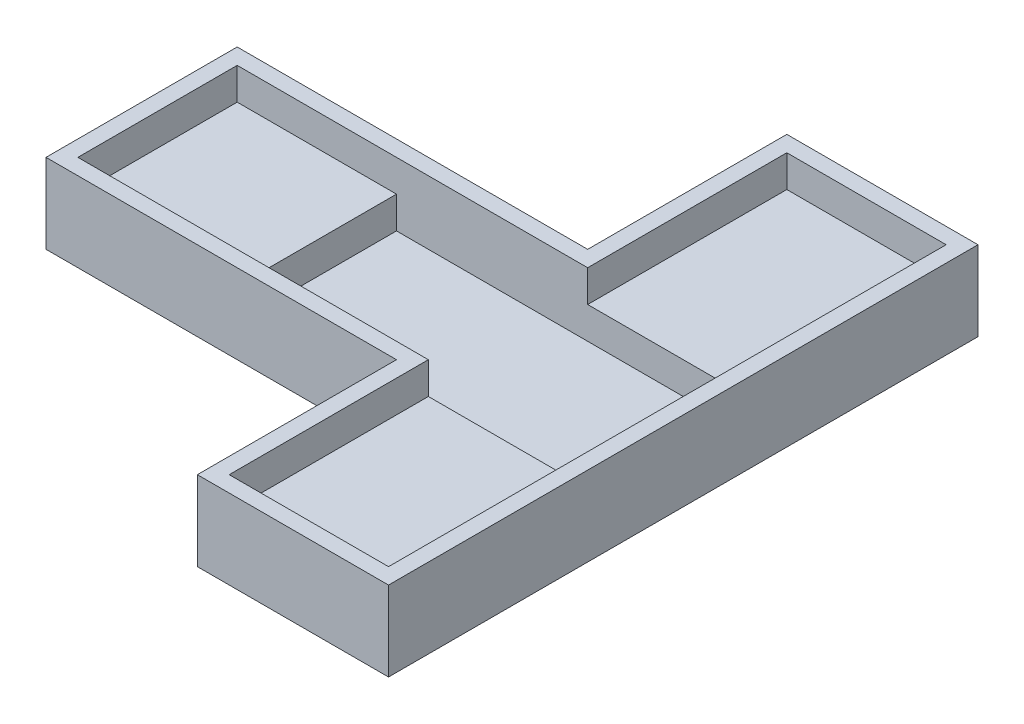
ISO-10303-21;
HEADER;
FILE_DESCRIPTION(('STEP AP214'),'2;1');
FILE_NAME('part.step','',(''),(''),'','','');
FILE_SCHEMA(('AUTOMOTIVE_DESIGN { 1 0 10303 214 1 1 1 1 }'));
ENDSEC;
DATA;
#1=APPLICATION_CONTEXT('core data for automotive mechanical design processes');
#2=APPLICATION_PROTOCOL_DEFINITION('international standard','automotive_design',2000,#1);
#3=PRODUCT_CONTEXT('',#1,'mechanical');
#4=PRODUCT('Part','Part','',(#3));
#5=PRODUCT_RELATED_PRODUCT_CATEGORY('part','',(#4));
#6=PRODUCT_DEFINITION_FORMATION('','',#4);
#7=PRODUCT_DEFINITION_CONTEXT('part definition',#1,'design');
#8=PRODUCT_DEFINITION('design','',#6,#7);
#9=PRODUCT_DEFINITION_SHAPE('','',#8);
#10=(LENGTH_UNIT() NAMED_UNIT(*) SI_UNIT(.MILLI.,.METRE.));
#11=(NAMED_UNIT(*) PLANE_ANGLE_UNIT() SI_UNIT($,.RADIAN.));
#12=(NAMED_UNIT(*) SI_UNIT($,.STERADIAN.) SOLID_ANGLE_UNIT());
#13=UNCERTAINTY_MEASURE_WITH_UNIT(LENGTH_MEASURE(1.E-05),#10,'distance_accuracy_value','');
#14=(GEOMETRIC_REPRESENTATION_CONTEXT(3) GLOBAL_UNCERTAINTY_ASSIGNED_CONTEXT((#13)) GLOBAL_UNIT_ASSIGNED_CONTEXT((#10,
#11,#12)) REPRESENTATION_CONTEXT('',''));
#15=CARTESIAN_POINT('',(0.,0.,0.));
#16=DIRECTION('',(0.,0.,1.));
#17=DIRECTION('',(1.,0.,0.));
#18=AXIS2_PLACEMENT_3D('',#15,#16,#17);
#19=CARTESIAN_POINT('',(0.,1.,0.));
#20=DIRECTION('',(0.,1.,0.));
#21=DIRECTION('',(0.,0.,1.));
#22=AXIS2_PLACEMENT_3D('',#19,#20,#21);
#23=PLANE('',#22);
#24=DIRECTION('',(1.,0.,0.));
#25=VECTOR('',#24,1.);
#26=CARTESIAN_POINT('',(0.,1.,5.));
#27=LINE('',#26,#25);
#28=CARTESIAN_POINT('',(-11.,1.,5.));
#29=VERTEX_POINT('',#28);
#30=CARTESIAN_POINT('',(11.,1.,5.));
#31=VERTEX_POINT('',#30);
#32=EDGE_CURVE('E11',#29,#31,#27,.T.);
#33=ORIENTED_EDGE('',*,*,#32,.T.);
#34=DIRECTION('',(0.,0.,1.));
#35=VECTOR('',#34,1.);
#36=CARTESIAN_POINT('',(11.,1.,0.));
#37=LINE('',#36,#35);
#38=CARTESIAN_POINT('',(11.,1.,-5.));
#39=VERTEX_POINT('',#38);
#40=EDGE_CURVE('E236',#39,#31,#37,.T.);
#41=ORIENTED_EDGE('',*,*,#40,.F.);
#42=DIRECTION('',(1.,0.,0.));
#43=VECTOR('',#42,1.);
#44=CARTESIAN_POINT('',(0.,1.,-5.));
#45=LINE('',#44,#43);
#46=CARTESIAN_POINT('',(-11.,1.,-5.));
#47=VERTEX_POINT('',#46);
#48=EDGE_CURVE('E45',#47,#39,#45,.T.);
#49=ORIENTED_EDGE('',*,*,#48,.F.);
#50=DIRECTION('',(0.,0.,-1.));
#51=VECTOR('',#50,1.);
#52=CARTESIAN_POINT('',(-11.,1.,-5.));
#53=LINE('',#52,#51);
#54=EDGE_CURVE('E269',#29,#47,#53,.T.);
#55=ORIENTED_EDGE('',*,*,#54,.F.);
#56=EDGE_LOOP('',(#33,#41,#49,#55));
#57=FACE_BOUND('',#56,.T.);
#58=ADVANCED_FACE('F37',(#57),#23,.T.);
#59=CARTESIAN_POINT('',(11.,0.,17.5));
#60=DIRECTION('',(1.,0.,0.));
#61=DIRECTION('',(0.,0.,-1.));
#62=AXIS2_PLACEMENT_3D('',#59,#60,#61);
#63=PLANE('',#62);
#64=DIRECTION('',(0.,-1.,0.));
#65=VECTOR('',#64,1.);
#66=CARTESIAN_POINT('',(11.,3.,5.));
#67=LINE('',#66,#65);
#68=CARTESIAN_POINT('',(11.,3.,5.));
#69=VERTEX_POINT('',#68);
#70=EDGE_CURVE('E276',#69,#31,#67,.T.);
#71=ORIENTED_EDGE('',*,*,#70,.F.);
#72=DIRECTION('',(0.,0.,-1.));
#73=VECTOR('',#72,1.);
#74=CARTESIAN_POINT('',(11.,3.,5.));
#75=LINE('',#74,#73);
#76=CARTESIAN_POINT('',(11.,3.,17.5));
#77=VERTEX_POINT('',#76);
#78=EDGE_CURVE('E186',#77,#69,#75,.T.);
#79=ORIENTED_EDGE('',*,*,#78,.F.);
#80=DIRECTION('',(0.,1.,0.));
#81=VECTOR('',#80,1.);
#82=CARTESIAN_POINT('',(11.,0.,17.5));
#83=LINE('',#82,#81);
#84=CARTESIAN_POINT('',(11.,5.,17.5));
#85=VERTEX_POINT('',#84);
#86=EDGE_CURVE('E185',#77,#85,#83,.T.);
#87=ORIENTED_EDGE('',*,*,#86,.T.);
#88=DIRECTION('',(0.,0.,-1.));
#89=VECTOR('',#88,1.);
#90=CARTESIAN_POINT('',(11.,5.,17.5));
#91=LINE('',#90,#89);
#92=CARTESIAN_POINT('',(11.,5.,-17.5));
#93=VERTEX_POINT('',#92);
#94=EDGE_CURVE('E305',#85,#93,#91,.T.);
#95=ORIENTED_EDGE('',*,*,#94,.T.);
#96=DIRECTION('',(0.,1.,0.));
#97=VECTOR('',#96,1.);
#98=CARTESIAN_POINT('',(11.,0.,-17.5));
#99=LINE('',#98,#97);
#100=CARTESIAN_POINT('',(11.,3.,-17.5));
#101=VERTEX_POINT('',#100);
#102=EDGE_CURVE('E210',#101,#93,#99,.T.);
#103=ORIENTED_EDGE('',*,*,#102,.F.);
#104=DIRECTION('',(0.,0.,-1.));
#105=VECTOR('',#104,1.);
#106=CARTESIAN_POINT('',(11.,3.,-5.));
#107=LINE('',#106,#105);
#108=CARTESIAN_POINT('',(11.,3.,-5.));
#109=VERTEX_POINT('',#108);
#110=EDGE_CURVE('E267',#109,#101,#107,.T.);
#111=ORIENTED_EDGE('',*,*,#110,.F.);
#112=DIRECTION('',(0.,-1.,0.));
#113=VECTOR('',#112,1.);
#114=CARTESIAN_POINT('',(11.,3.,-5.));
#115=LINE('',#114,#113);
#116=EDGE_CURVE('E257',#109,#39,#115,.T.);
#117=ORIENTED_EDGE('',*,*,#116,.T.);
#118=ORIENTED_EDGE('',*,*,#40,.T.);
#119=EDGE_LOOP('',(#71,#79,#87,#95,#103,#111,#117,#118));
#120=FACE_BOUND('',#119,.T.);
#121=ADVANCED_FACE('F265',(#120),#63,.F.);
#122=CARTESIAN_POINT('',(1.,0.,-17.5));
#123=DIRECTION('',(-1.,0.,0.));
#124=DIRECTION('',(0.,0.,1.));
#125=AXIS2_PLACEMENT_3D('',#122,#123,#124);
#126=PLANE('',#125);
#127=DIRECTION('',(0.,0.,1.));
#128=VECTOR('',#127,1.);
#129=CARTESIAN_POINT('',(0.999999999999999,3.,-5.));
#130=LINE('',#129,#128);
#131=CARTESIAN_POINT('',(1.,3.,-17.5));
#132=VERTEX_POINT('',#131);
#133=CARTESIAN_POINT('',(0.999999999999999,3.,-5.));
#134=VERTEX_POINT('',#133);
#135=EDGE_CURVE('E278',#132,#134,#130,.T.);
#136=ORIENTED_EDGE('',*,*,#135,.F.);
#137=DIRECTION('',(0.,1.,0.));
#138=VECTOR('',#137,1.);
#139=CARTESIAN_POINT('',(1.,0.,-17.5));
#140=LINE('',#139,#138);
#141=CARTESIAN_POINT('',(1.,5.,-17.5));
#142=VERTEX_POINT('',#141);
#143=EDGE_CURVE('E208',#132,#142,#140,.T.);
#144=ORIENTED_EDGE('',*,*,#143,.T.);
#145=DIRECTION('',(0.,0.,1.));
#146=VECTOR('',#145,1.);
#147=CARTESIAN_POINT('',(1.,5.,-17.5));
#148=LINE('',#147,#146);
#149=CARTESIAN_POINT('',(0.999999999999999,5.,-5.));
#150=VERTEX_POINT('',#149);
#151=EDGE_CURVE('E311',#142,#150,#148,.T.);
#152=ORIENTED_EDGE('',*,*,#151,.T.);
#153=DIRECTION('',(0.,1.,0.));
#154=VECTOR('',#153,1.);
#155=CARTESIAN_POINT('',(0.999999999999999,0.,-5.));
#156=LINE('',#155,#154);
#157=EDGE_CURVE('E60',#134,#150,#156,.T.);
#158=ORIENTED_EDGE('',*,*,#157,.F.);
#159=EDGE_LOOP('',(#136,#144,#152,#158));
#160=FACE_BOUND('',#159,.T.);
#161=ADVANCED_FACE('F392',(#160),#126,.F.);
#162=CARTESIAN_POINT('',(11.,0.,-17.5));
#163=DIRECTION('',(0.,0.,-1.));
#164=DIRECTION('',(-1.,0.,0.));
#165=AXIS2_PLACEMENT_3D('',#162,#163,#164);
#166=PLANE('',#165);
#167=DIRECTION('',(-1.,0.,0.));
#168=VECTOR('',#167,1.);
#169=CARTESIAN_POINT('',(0.999999999999999,3.,-17.5));
#170=LINE('',#169,#168);
#171=EDGE_CURVE('E270',#101,#132,#170,.T.);
#172=ORIENTED_EDGE('',*,*,#171,.F.);
#173=ORIENTED_EDGE('',*,*,#102,.T.);
#174=DIRECTION('',(-1.,0.,0.));
#175=VECTOR('',#174,1.);
#176=CARTESIAN_POINT('',(11.,5.,-17.5));
#177=LINE('',#176,#175);
#178=EDGE_CURVE('E308',#93,#142,#177,.T.);
#179=ORIENTED_EDGE('',*,*,#178,.T.);
#180=ORIENTED_EDGE('',*,*,#143,.F.);
#181=EDGE_LOOP('',(#172,#173,#179,#180));
#182=FACE_BOUND('',#181,.T.);
#183=ADVANCED_FACE('F511',(#182),#166,.F.);
#184=CARTESIAN_POINT('',(-21.,0.,5.));
#185=DIRECTION('',(0.,0.,1.));
#186=DIRECTION('',(1.,0.,0.));
#187=AXIS2_PLACEMENT_3D('',#184,#185,#186);
#188=PLANE('',#187);
#189=DIRECTION('',(0.,-1.,0.));
#190=VECTOR('',#189,1.);
#191=CARTESIAN_POINT('',(-11.,3.,5.));
#192=LINE('',#191,#190);
#193=CARTESIAN_POINT('',(-11.,3.,5.));
#194=VERTEX_POINT('',#193);
#195=EDGE_CURVE('E301',#194,#29,#192,.T.);
#196=ORIENTED_EDGE('',*,*,#195,.F.);
#197=DIRECTION('',(1.,0.,0.));
#198=VECTOR('',#197,1.);
#199=CARTESIAN_POINT('',(-21.,3.,5.));
#200=LINE('',#199,#198);
#201=CARTESIAN_POINT('',(-21.,3.,5.));
#202=VERTEX_POINT('',#201);
#203=EDGE_CURVE('E292',#202,#194,#200,.T.);
#204=ORIENTED_EDGE('',*,*,#203,.F.);
#205=DIRECTION('',(0.,1.,0.));
#206=VECTOR('',#205,1.);
#207=CARTESIAN_POINT('',(-21.,0.,5.));
#208=LINE('',#207,#206);
#209=CARTESIAN_POINT('',(-21.,5.,5.));
#210=VERTEX_POINT('',#209);
#211=EDGE_CURVE('E198',#202,#210,#208,.T.);
#212=ORIENTED_EDGE('',*,*,#211,.T.);
#213=DIRECTION('',(1.,0.,0.));
#214=VECTOR('',#213,1.);
#215=CARTESIAN_POINT('',(-21.,5.,5.));
#216=LINE('',#215,#214);
#217=CARTESIAN_POINT('',(1.,5.,5.));
#218=VERTEX_POINT('',#217);
#219=EDGE_CURVE('E319',#210,#218,#216,.T.);
#220=ORIENTED_EDGE('',*,*,#219,.T.);
#221=DIRECTION('',(0.,1.,0.));
#222=VECTOR('',#221,1.);
#223=CARTESIAN_POINT('',(1.,0.,5.));
#224=LINE('',#223,#222);
#225=CARTESIAN_POINT('',(1.,3.,5.));
#226=VERTEX_POINT('',#225);
#227=EDGE_CURVE('E193',#226,#218,#224,.T.);
#228=ORIENTED_EDGE('',*,*,#227,.F.);
#229=DIRECTION('',(-1.,0.,0.));
#230=VECTOR('',#229,1.);
#231=CARTESIAN_POINT('',(1.,3.,5.));
#232=LINE('',#231,#230);
#233=EDGE_CURVE('E52',#69,#226,#232,.T.);
#234=ORIENTED_EDGE('',*,*,#233,.F.);
#235=ORIENTED_EDGE('',*,*,#70,.T.);
#236=ORIENTED_EDGE('',*,*,#32,.F.);
#237=EDGE_LOOP('',(#196,#204,#212,#220,#228,#234,#235,#236));
#238=FACE_BOUND('',#237,.T.);
#239=ADVANCED_FACE('F277',(#238),#188,.F.);
#240=CARTESIAN_POINT('',(0.999999999999999,0.,-5.));
#241=DIRECTION('',(0.,0.,-1.));
#242=DIRECTION('',(-1.,0.,0.));
#243=AXIS2_PLACEMENT_3D('',#240,#241,#242);
#244=PLANE('',#243);
#245=DIRECTION('',(0.,-1.,0.));
#246=VECTOR('',#245,1.);
#247=CARTESIAN_POINT('',(-11.,3.,-5.));
#248=LINE('',#247,#246);
#249=CARTESIAN_POINT('',(-11.,3.,-5.));
#250=VERTEX_POINT('',#249);
#251=EDGE_CURVE('E259',#250,#47,#248,.T.);
#252=ORIENTED_EDGE('',*,*,#251,.T.);
#253=ORIENTED_EDGE('',*,*,#48,.T.);
#254=ORIENTED_EDGE('',*,*,#116,.F.);
#255=DIRECTION('',(1.,0.,0.));
#256=VECTOR('',#255,1.);
#257=CARTESIAN_POINT('',(0.999999999999999,3.,-5.));
#258=LINE('',#257,#256);
#259=EDGE_CURVE('E281',#134,#109,#258,.T.);
#260=ORIENTED_EDGE('',*,*,#259,.F.);
#261=ORIENTED_EDGE('',*,*,#157,.T.);
#262=DIRECTION('',(-1.,0.,0.));
#263=VECTOR('',#262,1.);
#264=CARTESIAN_POINT('',(0.999999999999999,5.,-5.));
#265=LINE('',#264,#263);
#266=CARTESIAN_POINT('',(-21.,5.,-5.));
#267=VERTEX_POINT('',#266);
#268=EDGE_CURVE('E313',#150,#267,#265,.T.);
#269=ORIENTED_EDGE('',*,*,#268,.T.);
#270=DIRECTION('',(0.,1.,0.));
#271=VECTOR('',#270,1.);
#272=CARTESIAN_POINT('',(-21.,0.,-5.));
#273=LINE('',#272,#271);
#274=CARTESIAN_POINT('',(-21.,3.,-5.));
#275=VERTEX_POINT('',#274);
#276=EDGE_CURVE('E205',#275,#267,#273,.T.);
#277=ORIENTED_EDGE('',*,*,#276,.F.);
#278=DIRECTION('',(-1.,0.,0.));
#279=VECTOR('',#278,1.);
#280=CARTESIAN_POINT('',(-21.,3.,-5.));
#281=LINE('',#280,#279);
#282=EDGE_CURVE('E297',#250,#275,#281,.T.);
#283=ORIENTED_EDGE('',*,*,#282,.F.);
#284=EDGE_LOOP('',(#252,#253,#254,#260,#261,#269,#277,#283));
#285=FACE_BOUND('',#284,.T.);
#286=ADVANCED_FACE('F256',(#285),#244,.F.);
#287=CARTESIAN_POINT('',(0.,0.,18.5));
#288=DIRECTION('',(0.,0.,1.));
#289=DIRECTION('',(1.,0.,0.));
#290=AXIS2_PLACEMENT_3D('',#287,#288,#289);
#291=PLANE('',#290);
#292=DIRECTION('',(0.,1.,0.));
#293=VECTOR('',#292,1.);
#294=CARTESIAN_POINT('',(12.,0.,18.5));
#295=LINE('',#294,#293);
#296=CARTESIAN_POINT('',(12.,0.,18.5));
#297=VERTEX_POINT('',#296);
#298=CARTESIAN_POINT('',(12.,5.,18.5));
#299=VERTEX_POINT('',#298);
#300=EDGE_CURVE('E233',#297,#299,#295,.T.);
#301=ORIENTED_EDGE('',*,*,#300,.T.);
#302=DIRECTION('',(1.,0.,0.));
#303=VECTOR('',#302,1.);
#304=CARTESIAN_POINT('',(0.,5.,18.5));
#305=LINE('',#304,#303);
#306=CARTESIAN_POINT('',(0.,5.,18.5));
#307=VERTEX_POINT('',#306);
#308=EDGE_CURVE('E323',#307,#299,#305,.T.);
#309=ORIENTED_EDGE('',*,*,#308,.F.);
#310=DIRECTION('',(0.,1.,0.));
#311=VECTOR('',#310,1.);
#312=CARTESIAN_POINT('',(0.,0.,18.5));
#313=LINE('',#312,#311);
#314=CARTESIAN_POINT('',(0.,0.,18.5));
#315=VERTEX_POINT('',#314);
#316=EDGE_CURVE('E234',#315,#307,#313,.T.);
#317=ORIENTED_EDGE('',*,*,#316,.F.);
#318=DIRECTION('',(1.,0.,0.));
#319=VECTOR('',#318,1.);
#320=CARTESIAN_POINT('',(0.,0.,18.5));
#321=LINE('',#320,#319);
#322=EDGE_CURVE('E192',#315,#297,#321,.T.);
#323=ORIENTED_EDGE('',*,*,#322,.T.);
#324=EDGE_LOOP('',(#301,#309,#317,#323));
#325=FACE_BOUND('',#324,.T.);
#326=ADVANCED_FACE('F351',(#325),#291,.T.);
#327=CARTESIAN_POINT('',(0.,0.,6.));
#328=DIRECTION('',(-1.,0.,0.));
#329=DIRECTION('',(0.,0.,1.));
#330=AXIS2_PLACEMENT_3D('',#327,#328,#329);
#331=PLANE('',#330);
#332=ORIENTED_EDGE('',*,*,#316,.T.);
#333=DIRECTION('',(0.,0.,1.));
#334=VECTOR('',#333,1.);
#335=CARTESIAN_POINT('',(0.,5.,6.));
#336=LINE('',#335,#334);
#337=CARTESIAN_POINT('',(0.,5.,6.));
#338=VERTEX_POINT('',#337);
#339=EDGE_CURVE('E201',#338,#307,#336,.T.);
#340=ORIENTED_EDGE('',*,*,#339,.F.);
#341=DIRECTION('',(0.,1.,0.));
#342=VECTOR('',#341,1.);
#343=CARTESIAN_POINT('',(0.,0.,6.));
#344=LINE('',#343,#342);
#345=CARTESIAN_POINT('',(0.,0.,6.));
#346=VERTEX_POINT('',#345);
#347=EDGE_CURVE('E237',#346,#338,#344,.T.);
#348=ORIENTED_EDGE('',*,*,#347,.F.);
#349=DIRECTION('',(0.,0.,1.));
#350=VECTOR('',#349,1.);
#351=CARTESIAN_POINT('',(0.,0.,6.));
#352=LINE('',#351,#350);
#353=EDGE_CURVE('E230',#346,#315,#352,.T.);
#354=ORIENTED_EDGE('',*,*,#353,.T.);
#355=EDGE_LOOP('',(#332,#340,#348,#354));
#356=FACE_BOUND('',#355,.T.);
#357=ADVANCED_FACE('F378',(#356),#331,.T.);
#358=CARTESIAN_POINT('',(-22.,0.,6.));
#359=DIRECTION('',(0.,0.,1.));
#360=DIRECTION('',(1.,0.,0.));
#361=AXIS2_PLACEMENT_3D('',#358,#359,#360);
#362=PLANE('',#361);
#363=ORIENTED_EDGE('',*,*,#347,.T.);
#364=DIRECTION('',(1.,0.,0.));
#365=VECTOR('',#364,1.);
#366=CARTESIAN_POINT('',(-22.,5.,6.));
#367=LINE('',#366,#365);
#368=CARTESIAN_POINT('',(-22.,5.,6.));
#369=VERTEX_POINT('',#368);
#370=EDGE_CURVE('E340',#369,#338,#367,.T.);
#371=ORIENTED_EDGE('',*,*,#370,.F.);
#372=DIRECTION('',(0.,1.,0.));
#373=VECTOR('',#372,1.);
#374=CARTESIAN_POINT('',(-22.,0.,6.));
#375=LINE('',#374,#373);
#376=CARTESIAN_POINT('',(-22.,0.,6.));
#377=VERTEX_POINT('',#376);
#378=EDGE_CURVE('E239',#377,#369,#375,.T.);
#379=ORIENTED_EDGE('',*,*,#378,.F.);
#380=DIRECTION('',(1.,0.,0.));
#381=VECTOR('',#380,1.);
#382=CARTESIAN_POINT('',(-22.,0.,6.));
#383=LINE('',#382,#381);
#384=EDGE_CURVE('E227',#377,#346,#383,.T.);
#385=ORIENTED_EDGE('',*,*,#384,.T.);
#386=EDGE_LOOP('',(#363,#371,#379,#385));
#387=FACE_BOUND('',#386,.T.);
#388=ADVANCED_FACE('F376',(#387),#362,.T.);
#389=CARTESIAN_POINT('',(-22.,0.,-5.99999999999999));
#390=DIRECTION('',(-1.,0.,0.));
#391=DIRECTION('',(0.,0.,1.));
#392=AXIS2_PLACEMENT_3D('',#389,#390,#391);
#393=PLANE('',#392);
#394=ORIENTED_EDGE('',*,*,#378,.T.);
#395=DIRECTION('',(0.,0.,1.));
#396=VECTOR('',#395,1.);
#397=CARTESIAN_POINT('',(-22.,5.,-5.99999999999999));
#398=LINE('',#397,#396);
#399=CARTESIAN_POINT('',(-22.,5.,-5.99999999999999));
#400=VERTEX_POINT('',#399);
#401=EDGE_CURVE('E338',#400,#369,#398,.T.);
#402=ORIENTED_EDGE('',*,*,#401,.F.);
#403=DIRECTION('',(0.,1.,0.));
#404=VECTOR('',#403,1.);
#405=CARTESIAN_POINT('',(-22.,0.,-5.99999999999999));
#406=LINE('',#405,#404);
#407=CARTESIAN_POINT('',(-22.,0.,-5.99999999999999));
#408=VERTEX_POINT('',#407);
#409=EDGE_CURVE('E241',#408,#400,#406,.T.);
#410=ORIENTED_EDGE('',*,*,#409,.F.);
#411=DIRECTION('',(0.,0.,1.));
#412=VECTOR('',#411,1.);
#413=CARTESIAN_POINT('',(-22.,0.,-5.99999999999999));
#414=LINE('',#413,#412);
#415=EDGE_CURVE('E224',#408,#377,#414,.T.);
#416=ORIENTED_EDGE('',*,*,#415,.T.);
#417=EDGE_LOOP('',(#394,#402,#410,#416));
#418=FACE_BOUND('',#417,.T.);
#419=ADVANCED_FACE('F374',(#418),#393,.T.);
#420=CARTESIAN_POINT('',(0.,0.,-6.));
#421=DIRECTION('',(0.,0.,-1.));
#422=DIRECTION('',(-1.,0.,0.));
#423=AXIS2_PLACEMENT_3D('',#420,#421,#422);
#424=PLANE('',#423);
#425=ORIENTED_EDGE('',*,*,#409,.T.);
#426=DIRECTION('',(-1.,0.,0.));
#427=VECTOR('',#426,1.);
#428=CARTESIAN_POINT('',(0.,5.,-6.));
#429=LINE('',#428,#427);
#430=CARTESIAN_POINT('',(0.,5.,-6.));
#431=VERTEX_POINT('',#430);
#432=EDGE_CURVE('E335',#431,#400,#429,.T.);
#433=ORIENTED_EDGE('',*,*,#432,.F.);
#434=DIRECTION('',(0.,1.,0.));
#435=VECTOR('',#434,1.);
#436=CARTESIAN_POINT('',(0.,0.,-6.));
#437=LINE('',#436,#435);
#438=CARTESIAN_POINT('',(0.,0.,-6.));
#439=VERTEX_POINT('',#438);
#440=EDGE_CURVE('E243',#439,#431,#437,.T.);
#441=ORIENTED_EDGE('',*,*,#440,.F.);
#442=DIRECTION('',(-1.,0.,0.));
#443=VECTOR('',#442,1.);
#444=CARTESIAN_POINT('',(0.,0.,-6.));
#445=LINE('',#444,#443);
#446=EDGE_CURVE('E221',#439,#408,#445,.T.);
#447=ORIENTED_EDGE('',*,*,#446,.T.);
#448=EDGE_LOOP('',(#425,#433,#441,#447));
#449=FACE_BOUND('',#448,.T.);
#450=ADVANCED_FACE('F370',(#449),#424,.T.);
#451=CARTESIAN_POINT('',(0.,0.,-18.5));
#452=DIRECTION('',(-1.,0.,0.));
#453=DIRECTION('',(0.,0.,1.));
#454=AXIS2_PLACEMENT_3D('',#451,#452,#453);
#455=PLANE('',#454);
#456=ORIENTED_EDGE('',*,*,#440,.T.);
#457=DIRECTION('',(0.,0.,1.));
#458=VECTOR('',#457,1.);
#459=CARTESIAN_POINT('',(0.,5.,-18.5));
#460=LINE('',#459,#458);
#461=CARTESIAN_POINT('',(0.,5.,-18.5));
#462=VERTEX_POINT('',#461);
#463=EDGE_CURVE('E332',#462,#431,#460,.T.);
#464=ORIENTED_EDGE('',*,*,#463,.F.);
#465=DIRECTION('',(0.,1.,0.));
#466=VECTOR('',#465,1.);
#467=CARTESIAN_POINT('',(0.,0.,-18.5));
#468=LINE('',#467,#466);
#469=CARTESIAN_POINT('',(0.,0.,-18.5));
#470=VERTEX_POINT('',#469);
#471=EDGE_CURVE('E245',#470,#462,#468,.T.);
#472=ORIENTED_EDGE('',*,*,#471,.F.);
#473=DIRECTION('',(0.,0.,1.));
#474=VECTOR('',#473,1.);
#475=CARTESIAN_POINT('',(0.,0.,-18.5));
#476=LINE('',#475,#474);
#477=EDGE_CURVE('E218',#470,#439,#476,.T.);
#478=ORIENTED_EDGE('',*,*,#477,.T.);
#479=EDGE_LOOP('',(#456,#464,#472,#478));
#480=FACE_BOUND('',#479,.T.);
#481=ADVANCED_FACE('F364',(#480),#455,.T.);
#482=CARTESIAN_POINT('',(12.,0.,-18.5));
#483=DIRECTION('',(0.,0.,-1.));
#484=DIRECTION('',(-1.,0.,0.));
#485=AXIS2_PLACEMENT_3D('',#482,#483,#484);
#486=PLANE('',#485);
#487=ORIENTED_EDGE('',*,*,#471,.T.);
#488=DIRECTION('',(-1.,0.,0.));
#489=VECTOR('',#488,1.);
#490=CARTESIAN_POINT('',(12.,5.,-18.5));
#491=LINE('',#490,#489);
#492=CARTESIAN_POINT('',(12.,5.,-18.5));
#493=VERTEX_POINT('',#492);
#494=EDGE_CURVE('E329',#493,#462,#491,.T.);
#495=ORIENTED_EDGE('',*,*,#494,.F.);
#496=DIRECTION('',(0.,1.,0.));
#497=VECTOR('',#496,1.);
#498=CARTESIAN_POINT('',(12.,0.,-18.5));
#499=LINE('',#498,#497);
#500=CARTESIAN_POINT('',(12.,0.,-18.5));
#501=VERTEX_POINT('',#500);
#502=EDGE_CURVE('E247',#501,#493,#499,.T.);
#503=ORIENTED_EDGE('',*,*,#502,.F.);
#504=DIRECTION('',(-1.,0.,0.));
#505=VECTOR('',#504,1.);
#506=CARTESIAN_POINT('',(12.,0.,-18.5));
#507=LINE('',#506,#505);
#508=EDGE_CURVE('E215',#501,#470,#507,.T.);
#509=ORIENTED_EDGE('',*,*,#508,.T.);
#510=EDGE_LOOP('',(#487,#495,#503,#509));
#511=FACE_BOUND('',#510,.T.);
#512=ADVANCED_FACE('F360',(#511),#486,.T.);
#513=CARTESIAN_POINT('',(12.,0.,18.5));
#514=DIRECTION('',(1.,0.,0.));
#515=DIRECTION('',(0.,0.,-1.));
#516=AXIS2_PLACEMENT_3D('',#513,#514,#515);
#517=PLANE('',#516);
#518=ORIENTED_EDGE('',*,*,#502,.T.);
#519=DIRECTION('',(0.,0.,-1.));
#520=VECTOR('',#519,1.);
#521=CARTESIAN_POINT('',(12.,5.,18.5));
#522=LINE('',#521,#520);
#523=EDGE_CURVE('E326',#299,#493,#522,.T.);
#524=ORIENTED_EDGE('',*,*,#523,.F.);
#525=ORIENTED_EDGE('',*,*,#300,.F.);
#526=DIRECTION('',(0.,0.,-1.));
#527=VECTOR('',#526,1.);
#528=CARTESIAN_POINT('',(12.,0.,18.5));
#529=LINE('',#528,#527);
#530=EDGE_CURVE('E196',#297,#501,#529,.T.);
#531=ORIENTED_EDGE('',*,*,#530,.T.);
#532=EDGE_LOOP('',(#518,#524,#525,#531));
#533=FACE_BOUND('',#532,.T.);
#534=ADVANCED_FACE('F356',(#533),#517,.T.);
#535=CARTESIAN_POINT('',(1.,0.,17.5));
#536=DIRECTION('',(0.,0.,1.));
#537=DIRECTION('',(1.,0.,0.));
#538=AXIS2_PLACEMENT_3D('',#535,#536,#537);
#539=PLANE('',#538);
#540=ORIENTED_EDGE('',*,*,#86,.F.);
#541=DIRECTION('',(1.,0.,0.));
#542=VECTOR('',#541,1.);
#543=CARTESIAN_POINT('',(1.,3.,17.5));
#544=LINE('',#543,#542);
#545=CARTESIAN_POINT('',(1.,3.,17.5));
#546=VERTEX_POINT('',#545);
#547=EDGE_CURVE('E173',#546,#77,#544,.T.);
#548=ORIENTED_EDGE('',*,*,#547,.F.);
#549=DIRECTION('',(0.,1.,0.));
#550=VECTOR('',#549,1.);
#551=CARTESIAN_POINT('',(1.,0.,17.5));
#552=LINE('',#551,#550);
#553=CARTESIAN_POINT('',(1.,5.,17.5));
#554=VERTEX_POINT('',#553);
#555=EDGE_CURVE('E183',#546,#554,#552,.T.);
#556=ORIENTED_EDGE('',*,*,#555,.T.);
#557=DIRECTION('',(1.,0.,0.));
#558=VECTOR('',#557,1.);
#559=CARTESIAN_POINT('',(1.,5.,17.5));
#560=LINE('',#559,#558);
#561=EDGE_CURVE('E303',#554,#85,#560,.T.);
#562=ORIENTED_EDGE('',*,*,#561,.T.);
#563=EDGE_LOOP('',(#540,#548,#556,#562));
#564=FACE_BOUND('',#563,.T.);
#565=ADVANCED_FACE('F181',(#564),#539,.F.);
#566=CARTESIAN_POINT('',(1.,0.,5.));
#567=DIRECTION('',(-1.,0.,0.));
#568=DIRECTION('',(0.,0.,1.));
#569=AXIS2_PLACEMENT_3D('',#566,#567,#568);
#570=PLANE('',#569);
#571=ORIENTED_EDGE('',*,*,#555,.F.);
#572=DIRECTION('',(0.,0.,1.));
#573=VECTOR('',#572,1.);
#574=CARTESIAN_POINT('',(1.,3.,5.));
#575=LINE('',#574,#573);
#576=EDGE_CURVE('E170',#226,#546,#575,.T.);
#577=ORIENTED_EDGE('',*,*,#576,.F.);
#578=ORIENTED_EDGE('',*,*,#227,.T.);
#579=DIRECTION('',(0.,0.,1.));
#580=VECTOR('',#579,1.);
#581=CARTESIAN_POINT('',(1.,5.,5.));
#582=LINE('',#581,#580);
#583=EDGE_CURVE('E190',#218,#554,#582,.T.);
#584=ORIENTED_EDGE('',*,*,#583,.T.);
#585=EDGE_LOOP('',(#571,#577,#578,#584));
#586=FACE_BOUND('',#585,.T.);
#587=ADVANCED_FACE('F188',(#586),#570,.F.);
#588=CARTESIAN_POINT('',(-21.,0.,-5.));
#589=DIRECTION('',(-1.,0.,0.));
#590=DIRECTION('',(0.,0.,1.));
#591=AXIS2_PLACEMENT_3D('',#588,#589,#590);
#592=PLANE('',#591);
#593=ORIENTED_EDGE('',*,*,#211,.F.);
#594=DIRECTION('',(0.,0.,1.));
#595=VECTOR('',#594,1.);
#596=CARTESIAN_POINT('',(-21.,3.,-5.));
#597=LINE('',#596,#595);
#598=EDGE_CURVE('E290',#275,#202,#597,.T.);
#599=ORIENTED_EDGE('',*,*,#598,.F.);
#600=ORIENTED_EDGE('',*,*,#276,.T.);
#601=DIRECTION('',(0.,0.,1.));
#602=VECTOR('',#601,1.);
#603=CARTESIAN_POINT('',(-21.,5.,-5.));
#604=LINE('',#603,#602);
#605=EDGE_CURVE('E316',#267,#210,#604,.T.);
#606=ORIENTED_EDGE('',*,*,#605,.T.);
#607=EDGE_LOOP('',(#593,#599,#600,#606));
#608=FACE_BOUND('',#607,.T.);
#609=ADVANCED_FACE('F437',(#608),#592,.F.);
#610=CARTESIAN_POINT('',(0.,5.,0.));
#611=DIRECTION('',(0.,1.,0.));
#612=DIRECTION('',(0.,0.,1.));
#613=AXIS2_PLACEMENT_3D('',#610,#611,#612);
#614=PLANE('',#613);
#615=ORIENTED_EDGE('',*,*,#308,.T.);
#616=ORIENTED_EDGE('',*,*,#523,.T.);
#617=ORIENTED_EDGE('',*,*,#494,.T.);
#618=ORIENTED_EDGE('',*,*,#463,.T.);
#619=ORIENTED_EDGE('',*,*,#432,.T.);
#620=ORIENTED_EDGE('',*,*,#401,.T.);
#621=ORIENTED_EDGE('',*,*,#370,.T.);
#622=ORIENTED_EDGE('',*,*,#339,.T.);
#623=EDGE_LOOP('',(#615,#616,#617,#618,#619,#620,#621,#622));
#624=FACE_BOUND('',#623,.T.);
#625=ORIENTED_EDGE('',*,*,#94,.F.);
#626=ORIENTED_EDGE('',*,*,#561,.F.);
#627=ORIENTED_EDGE('',*,*,#583,.F.);
#628=ORIENTED_EDGE('',*,*,#219,.F.);
#629=ORIENTED_EDGE('',*,*,#605,.F.);
#630=ORIENTED_EDGE('',*,*,#268,.F.);
#631=ORIENTED_EDGE('',*,*,#151,.F.);
#632=ORIENTED_EDGE('',*,*,#178,.F.);
#633=EDGE_LOOP('',(#625,#626,#627,#628,#629,#630,#631,#632));
#634=FACE_BOUND('',#633,.T.);
#635=ADVANCED_FACE('F347',(#624,#634),#614,.T.);
#636=CARTESIAN_POINT('',(0.,0.,0.));
#637=DIRECTION('',(0.,1.,0.));
#638=DIRECTION('',(0.,0.,1.));
#639=AXIS2_PLACEMENT_3D('',#636,#637,#638);
#640=PLANE('',#639);
#641=ORIENTED_EDGE('',*,*,#322,.F.);
#642=ORIENTED_EDGE('',*,*,#353,.F.);
#643=ORIENTED_EDGE('',*,*,#384,.F.);
#644=ORIENTED_EDGE('',*,*,#415,.F.);
#645=ORIENTED_EDGE('',*,*,#446,.F.);
#646=ORIENTED_EDGE('',*,*,#477,.F.);
#647=ORIENTED_EDGE('',*,*,#508,.F.);
#648=ORIENTED_EDGE('',*,*,#530,.F.);
#649=EDGE_LOOP('',(#641,#642,#643,#644,#645,#646,#647,#648));
#650=FACE_BOUND('',#649,.T.);
#651=ADVANCED_FACE('F39',(#650),#640,.F.);
#652=CARTESIAN_POINT('',(-11.,3.,-5.));
#653=DIRECTION('',(-1.,0.,0.));
#654=DIRECTION('',(0.,0.,1.));
#655=AXIS2_PLACEMENT_3D('',#652,#653,#654);
#656=PLANE('',#655);
#657=ORIENTED_EDGE('',*,*,#54,.T.);
#658=ORIENTED_EDGE('',*,*,#251,.F.);
#659=DIRECTION('',(0.,0.,-1.));
#660=VECTOR('',#659,1.);
#661=CARTESIAN_POINT('',(-11.,3.,-5.));
#662=LINE('',#661,#660);
#663=EDGE_CURVE('E294',#194,#250,#662,.T.);
#664=ORIENTED_EDGE('',*,*,#663,.F.);
#665=ORIENTED_EDGE('',*,*,#195,.T.);
#666=EDGE_LOOP('',(#657,#658,#664,#665));
#667=FACE_BOUND('',#666,.T.);
#668=ADVANCED_FACE('F457',(#667),#656,.F.);
#669=CARTESIAN_POINT('',(0.,3.,0.));
#670=DIRECTION('',(0.,1.,0.));
#671=DIRECTION('',(0.,0.,1.));
#672=AXIS2_PLACEMENT_3D('',#669,#670,#671);
#673=PLANE('',#672);
#674=ORIENTED_EDGE('',*,*,#598,.T.);
#675=ORIENTED_EDGE('',*,*,#203,.T.);
#676=ORIENTED_EDGE('',*,*,#663,.T.);
#677=ORIENTED_EDGE('',*,*,#282,.T.);
#678=EDGE_LOOP('',(#674,#675,#676,#677));
#679=FACE_BOUND('',#678,.T.);
#680=ADVANCED_FACE('F462',(#679),#673,.T.);
#681=CARTESIAN_POINT('',(0.,3.,0.));
#682=DIRECTION('',(0.,-1.,0.));
#683=DIRECTION('',(0.,0.,-1.));
#684=AXIS2_PLACEMENT_3D('',#681,#682,#683);
#685=PLANE('',#684);
#686=ORIENTED_EDGE('',*,*,#135,.T.);
#687=ORIENTED_EDGE('',*,*,#259,.T.);
#688=ORIENTED_EDGE('',*,*,#110,.T.);
#689=ORIENTED_EDGE('',*,*,#171,.T.);
#690=EDGE_LOOP('',(#686,#687,#688,#689));
#691=FACE_BOUND('',#690,.T.);
#692=ADVANCED_FACE('F470',(#691),#685,.F.);
#693=CARTESIAN_POINT('',(0.,3.,0.));
#694=DIRECTION('',(0.,1.,0.));
#695=DIRECTION('',(0.,0.,1.));
#696=AXIS2_PLACEMENT_3D('',#693,#694,#695);
#697=PLANE('',#696);
#698=ORIENTED_EDGE('',*,*,#576,.T.);
#699=ORIENTED_EDGE('',*,*,#547,.T.);
#700=ORIENTED_EDGE('',*,*,#78,.T.);
#701=ORIENTED_EDGE('',*,*,#233,.T.);
#702=EDGE_LOOP('',(#698,#699,#700,#701));
#703=FACE_BOUND('',#702,.T.);
#704=ADVANCED_FACE('F172',(#703),#697,.T.);
#705=CLOSED_SHELL('',(#58,#121,#161,#183,#239,#286,#326,#357,#388,#419,#450,#481,#512,#534,#565,
#587,#609,#635,#651,#668,#680,#692,#704));
#706=MANIFOLD_SOLID_BREP('B2',#705);
#707=ADVANCED_BREP_SHAPE_REPRESENTATION('',(#18,#706),#14);
#708=SHAPE_DEFINITION_REPRESENTATION(#9,#707);
ENDSEC;
END-ISO-10303-21;
